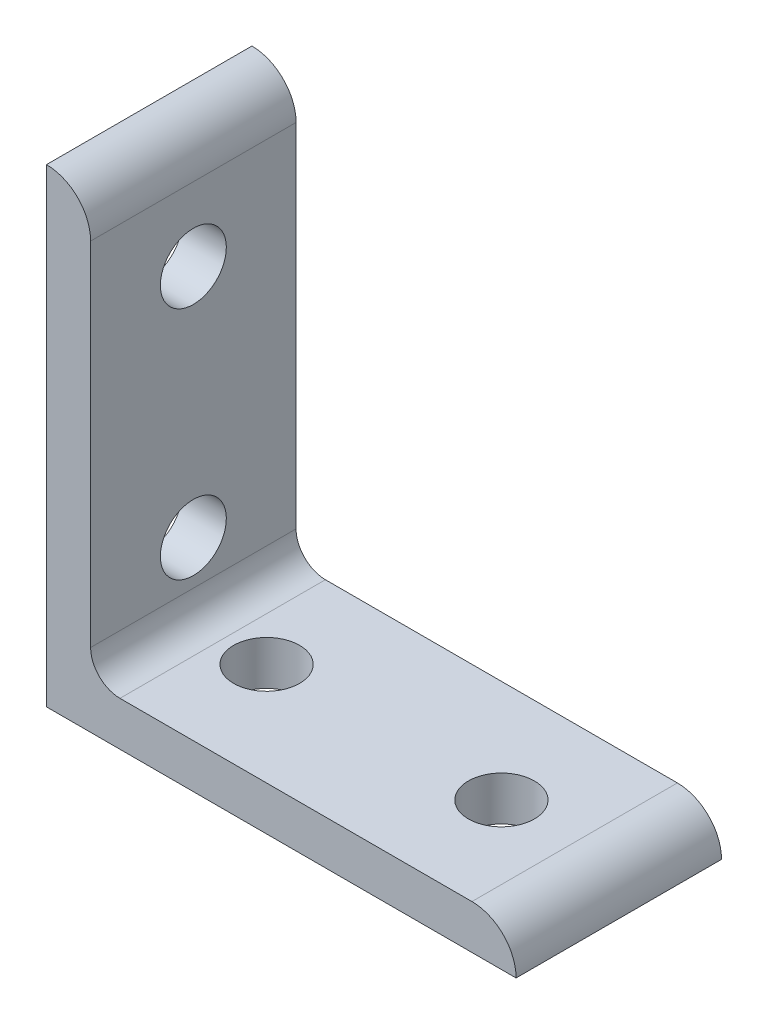
ISO-10303-21;
HEADER;
FILE_DESCRIPTION(('STEP AP214'),'2;1');
FILE_NAME('part.step','',(''),(''),'','','');
FILE_SCHEMA(('AUTOMOTIVE_DESIGN { 1 0 10303 214 1 1 1 1 }'));
ENDSEC;
DATA;
#1=APPLICATION_CONTEXT('core data for automotive mechanical design processes');
#2=APPLICATION_PROTOCOL_DEFINITION('international standard','automotive_design',2000,#1);
#3=PRODUCT_CONTEXT('',#1,'mechanical');
#4=PRODUCT('Part','Part','',(#3));
#5=PRODUCT_RELATED_PRODUCT_CATEGORY('part','',(#4));
#6=PRODUCT_DEFINITION_FORMATION('','',#4);
#7=PRODUCT_DEFINITION_CONTEXT('part definition',#1,'design');
#8=PRODUCT_DEFINITION('design','',#6,#7);
#9=PRODUCT_DEFINITION_SHAPE('','',#8);
#10=(LENGTH_UNIT() NAMED_UNIT(*) SI_UNIT(.MILLI.,.METRE.));
#11=(NAMED_UNIT(*) PLANE_ANGLE_UNIT() SI_UNIT($,.RADIAN.));
#12=(NAMED_UNIT(*) SI_UNIT($,.STERADIAN.) SOLID_ANGLE_UNIT());
#13=UNCERTAINTY_MEASURE_WITH_UNIT(LENGTH_MEASURE(1.E-05),#10,'distance_accuracy_value','');
#14=(GEOMETRIC_REPRESENTATION_CONTEXT(3) GLOBAL_UNCERTAINTY_ASSIGNED_CONTEXT((#13)) GLOBAL_UNIT_ASSIGNED_CONTEXT((#10,
#11,#12)) REPRESENTATION_CONTEXT('',''));
#15=CARTESIAN_POINT('',(0.,0.,0.));
#16=DIRECTION('',(0.,0.,1.));
#17=DIRECTION('',(1.,0.,0.));
#18=AXIS2_PLACEMENT_3D('',#15,#16,#17);
#19=CARTESIAN_POINT('',(4.7752,46.0248,11.1125));
#20=DIRECTION('',(-1.,0.,0.));
#21=DIRECTION('',(0.,-1.,0.));
#22=AXIS2_PLACEMENT_3D('',#19,#20,#21);
#23=PLANE('',#22);
#24=CARTESIAN_POINT('',(4.7752,12.7,0.));
#25=DIRECTION('',(-1.,0.,0.));
#26=DIRECTION('',(0.,-1.,0.));
#27=AXIS2_PLACEMENT_3D('',#24,#25,#26);
#28=CIRCLE('',#27,3.5687);
#29=CARTESIAN_POINT('',(4.7752,9.1313,0.));
#30=VERTEX_POINT('',#29);
#31=EDGE_CURVE('E208',#30,#30,#28,.F.);
#32=ORIENTED_EDGE('',*,*,#31,.F.);
#33=EDGE_LOOP('',(#32));
#34=FACE_BOUND('',#33,.T.);
#35=DIRECTION('',(0.,1.,0.));
#36=VECTOR('',#35,1.);
#37=CARTESIAN_POINT('',(4.7752,46.0248,-11.1125));
#38=LINE('',#37,#36);
#39=CARTESIAN_POINT('',(4.7752,7.9502,-11.1125));
#40=VERTEX_POINT('',#39);
#41=CARTESIAN_POINT('',(4.77519999999999,46.0248,-11.1125));
#42=VERTEX_POINT('',#41);
#43=EDGE_CURVE('E137',#40,#42,#38,.T.);
#44=ORIENTED_EDGE('',*,*,#43,.T.);
#45=DIRECTION('',(0.,0.,-1.));
#46=VECTOR('',#45,1.);
#47=CARTESIAN_POINT('',(4.77519999999999,46.0248,11.1125));
#48=LINE('',#47,#46);
#49=CARTESIAN_POINT('',(4.77519999999999,46.0248,11.1125));
#50=VERTEX_POINT('',#49);
#51=EDGE_CURVE('E134',#50,#42,#48,.T.);
#52=ORIENTED_EDGE('',*,*,#51,.F.);
#53=DIRECTION('',(0.,1.,0.));
#54=VECTOR('',#53,1.);
#55=CARTESIAN_POINT('',(4.7752,46.0248,11.1125));
#56=LINE('',#55,#54);
#57=CARTESIAN_POINT('',(4.7752,7.9502,11.1125));
#58=VERTEX_POINT('',#57);
#59=EDGE_CURVE('E122',#58,#50,#56,.T.);
#60=ORIENTED_EDGE('',*,*,#59,.F.);
#61=DIRECTION('',(0.,0.,-1.));
#62=VECTOR('',#61,1.);
#63=CARTESIAN_POINT('',(4.7752,7.9502,11.1125));
#64=LINE('',#63,#62);
#65=EDGE_CURVE('E139',#58,#40,#64,.T.);
#66=ORIENTED_EDGE('',*,*,#65,.T.);
#67=EDGE_LOOP('',(#44,#52,#60,#66));
#68=FACE_BOUND('',#67,.T.);
#69=CARTESIAN_POINT('',(4.77519999999999,38.1,0.));
#70=DIRECTION('',(-1.,0.,0.));
#71=DIRECTION('',(0.,-1.,0.));
#72=AXIS2_PLACEMENT_3D('',#69,#70,#71);
#73=CIRCLE('',#72,3.5687);
#74=CARTESIAN_POINT('',(4.77519999999999,34.5313,0.));
#75=VERTEX_POINT('',#74);
#76=EDGE_CURVE('E212',#75,#75,#73,.F.);
#77=ORIENTED_EDGE('',*,*,#76,.F.);
#78=EDGE_LOOP('',(#77));
#79=FACE_BOUND('',#78,.T.);
#80=ADVANCED_FACE('F38',(#34,#68,#79),#23,.F.);
#81=CARTESIAN_POINT('',(0.,0.,11.1125));
#82=DIRECTION('',(1.,0.,0.));
#83=DIRECTION('',(0.,0.,-1.));
#84=AXIS2_PLACEMENT_3D('',#81,#82,#83);
#85=PLANE('',#84);
#86=CARTESIAN_POINT('',(0.,12.7,0.));
#87=DIRECTION('',(1.,0.,0.));
#88=DIRECTION('',(0.,0.,-1.));
#89=AXIS2_PLACEMENT_3D('',#86,#87,#88);
#90=CIRCLE('',#89,3.5687);
#91=CARTESIAN_POINT('',(0.,12.7,-3.5687));
#92=VERTEX_POINT('',#91);
#93=EDGE_CURVE('E210',#92,#92,#90,.T.);
#94=ORIENTED_EDGE('',*,*,#93,.T.);
#95=EDGE_LOOP('',(#94));
#96=FACE_BOUND('',#95,.T.);
#97=DIRECTION('',(0.,-1.,0.));
#98=VECTOR('',#97,1.);
#99=CARTESIAN_POINT('',(0.,0.,-11.1125));
#100=LINE('',#99,#98);
#101=CARTESIAN_POINT('',(0.,50.8,-11.1125));
#102=VERTEX_POINT('',#101);
#103=CARTESIAN_POINT('',(0.,0.,-11.1125));
#104=VERTEX_POINT('',#103);
#105=EDGE_CURVE('E100',#102,#104,#100,.T.);
#106=ORIENTED_EDGE('',*,*,#105,.T.);
#107=DIRECTION('',(0.,0.,-1.));
#108=VECTOR('',#107,1.);
#109=CARTESIAN_POINT('',(0.,0.,11.1125));
#110=LINE('',#109,#108);
#111=CARTESIAN_POINT('',(0.,0.,11.1125));
#112=VERTEX_POINT('',#111);
#113=EDGE_CURVE('E146',#112,#104,#110,.T.);
#114=ORIENTED_EDGE('',*,*,#113,.F.);
#115=DIRECTION('',(0.,-1.,0.));
#116=VECTOR('',#115,1.);
#117=CARTESIAN_POINT('',(0.,0.,11.1125));
#118=LINE('',#117,#116);
#119=CARTESIAN_POINT('',(0.,50.8,11.1125));
#120=VERTEX_POINT('',#119);
#121=EDGE_CURVE('E60',#120,#112,#118,.T.);
#122=ORIENTED_EDGE('',*,*,#121,.F.);
#123=DIRECTION('',(0.,0.,-1.));
#124=VECTOR('',#123,1.);
#125=CARTESIAN_POINT('',(0.,50.8,11.1125));
#126=LINE('',#125,#124);
#127=EDGE_CURVE('E140',#120,#102,#126,.T.);
#128=ORIENTED_EDGE('',*,*,#127,.T.);
#129=EDGE_LOOP('',(#106,#114,#122,#128));
#130=FACE_BOUND('',#129,.T.);
#131=CARTESIAN_POINT('',(0.,38.1,0.));
#132=DIRECTION('',(1.,0.,0.));
#133=DIRECTION('',(0.,0.,-1.));
#134=AXIS2_PLACEMENT_3D('',#131,#132,#133);
#135=CIRCLE('',#134,3.5687);
#136=CARTESIAN_POINT('',(0.,38.1,-3.5687));
#137=VERTEX_POINT('',#136);
#138=EDGE_CURVE('E218',#137,#137,#135,.T.);
#139=ORIENTED_EDGE('',*,*,#138,.T.);
#140=EDGE_LOOP('',(#139));
#141=FACE_BOUND('',#140,.T.);
#142=ADVANCED_FACE('F225',(#96,#130,#141),#85,.F.);
#143=CARTESIAN_POINT('',(50.8,0.,11.1125));
#144=DIRECTION('',(0.,1.,0.));
#145=DIRECTION('',(-1.,0.,0.));
#146=AXIS2_PLACEMENT_3D('',#143,#144,#145);
#147=PLANE('',#146);
#148=CARTESIAN_POINT('',(12.7,0.,0.));
#149=DIRECTION('',(0.,1.,0.));
#150=DIRECTION('',(0.,0.,1.));
#151=AXIS2_PLACEMENT_3D('',#148,#149,#150);
#152=CIRCLE('',#151,3.5687);
#153=CARTESIAN_POINT('',(12.7,0.,3.5687));
#154=VERTEX_POINT('',#153);
#155=EDGE_CURVE('E185',#154,#154,#152,.T.);
#156=ORIENTED_EDGE('',*,*,#155,.T.);
#157=EDGE_LOOP('',(#156));
#158=FACE_BOUND('',#157,.T.);
#159=DIRECTION('',(1.,0.,0.));
#160=VECTOR('',#159,1.);
#161=CARTESIAN_POINT('',(50.8,0.,-11.1125));
#162=LINE('',#161,#160);
#163=CARTESIAN_POINT('',(50.8,0.,-11.1125));
#164=VERTEX_POINT('',#163);
#165=EDGE_CURVE('E150',#104,#164,#162,.T.);
#166=ORIENTED_EDGE('',*,*,#165,.T.);
#167=DIRECTION('',(0.,0.,-1.));
#168=VECTOR('',#167,1.);
#169=CARTESIAN_POINT('',(50.8,0.,11.1125));
#170=LINE('',#169,#168);
#171=CARTESIAN_POINT('',(50.8,0.,11.1125));
#172=VERTEX_POINT('',#171);
#173=EDGE_CURVE('E11',#172,#164,#170,.T.);
#174=ORIENTED_EDGE('',*,*,#173,.F.);
#175=DIRECTION('',(1.,0.,0.));
#176=VECTOR('',#175,1.);
#177=CARTESIAN_POINT('',(50.8,0.,11.1125));
#178=LINE('',#177,#176);
#179=EDGE_CURVE('E170',#112,#172,#178,.T.);
#180=ORIENTED_EDGE('',*,*,#179,.F.);
#181=ORIENTED_EDGE('',*,*,#113,.T.);
#182=EDGE_LOOP('',(#166,#174,#180,#181));
#183=FACE_BOUND('',#182,.T.);
#184=CARTESIAN_POINT('',(38.1,0.,0.));
#185=DIRECTION('',(0.,1.,0.));
#186=DIRECTION('',(0.,0.,1.));
#187=AXIS2_PLACEMENT_3D('',#184,#185,#186);
#188=CIRCLE('',#187,3.56869999999999);
#189=CARTESIAN_POINT('',(38.1,0.,3.56869999999999));
#190=VERTEX_POINT('',#189);
#191=EDGE_CURVE('E196',#190,#190,#188,.T.);
#192=ORIENTED_EDGE('',*,*,#191,.T.);
#193=EDGE_LOOP('',(#192));
#194=FACE_BOUND('',#193,.T.);
#195=ADVANCED_FACE('F40',(#158,#183,#194),#147,.F.);
#196=CARTESIAN_POINT('',(7.9502,4.7752,11.1125));
#197=DIRECTION('',(0.,-1.,0.));
#198=DIRECTION('',(1.,0.,0.));
#199=AXIS2_PLACEMENT_3D('',#196,#197,#198);
#200=PLANE('',#199);
#201=CARTESIAN_POINT('',(12.7,4.7752,0.));
#202=DIRECTION('',(0.,-1.,0.));
#203=DIRECTION('',(1.,0.,0.));
#204=AXIS2_PLACEMENT_3D('',#201,#202,#203);
#205=CIRCLE('',#204,3.5687);
#206=CARTESIAN_POINT('',(16.2687,4.7752,0.));
#207=VERTEX_POINT('',#206);
#208=EDGE_CURVE('E155',#207,#207,#205,.F.);
#209=ORIENTED_EDGE('',*,*,#208,.F.);
#210=EDGE_LOOP('',(#209));
#211=FACE_BOUND('',#210,.T.);
#212=DIRECTION('',(-1.,0.,0.));
#213=VECTOR('',#212,1.);
#214=CARTESIAN_POINT('',(7.9502,4.7752,-11.1125));
#215=LINE('',#214,#213);
#216=CARTESIAN_POINT('',(46.0248,4.7752,-11.1125));
#217=VERTEX_POINT('',#216);
#218=CARTESIAN_POINT('',(7.9502,4.7752,-11.1125));
#219=VERTEX_POINT('',#218);
#220=EDGE_CURVE('E158',#217,#219,#215,.T.);
#221=ORIENTED_EDGE('',*,*,#220,.T.);
#222=DIRECTION('',(0.,0.,-1.));
#223=VECTOR('',#222,1.);
#224=CARTESIAN_POINT('',(7.9502,4.7752,11.1125));
#225=LINE('',#224,#223);
#226=CARTESIAN_POINT('',(7.9502,4.7752,11.1125));
#227=VERTEX_POINT('',#226);
#228=EDGE_CURVE('E177',#227,#219,#225,.T.);
#229=ORIENTED_EDGE('',*,*,#228,.F.);
#230=DIRECTION('',(-1.,0.,0.));
#231=VECTOR('',#230,1.);
#232=CARTESIAN_POINT('',(7.9502,4.7752,11.1125));
#233=LINE('',#232,#231);
#234=CARTESIAN_POINT('',(46.0248,4.7752,11.1125));
#235=VERTEX_POINT('',#234);
#236=EDGE_CURVE('E204',#235,#227,#233,.T.);
#237=ORIENTED_EDGE('',*,*,#236,.F.);
#238=DIRECTION('',(0.,0.,-1.));
#239=VECTOR('',#238,1.);
#240=CARTESIAN_POINT('',(46.0248,4.7752,11.1125));
#241=LINE('',#240,#239);
#242=EDGE_CURVE('E49',#235,#217,#241,.T.);
#243=ORIENTED_EDGE('',*,*,#242,.T.);
#244=EDGE_LOOP('',(#221,#229,#237,#243));
#245=FACE_BOUND('',#244,.T.);
#246=CARTESIAN_POINT('',(38.1,4.7752,0.));
#247=DIRECTION('',(0.,-1.,0.));
#248=DIRECTION('',(1.,0.,0.));
#249=AXIS2_PLACEMENT_3D('',#246,#247,#248);
#250=CIRCLE('',#249,3.56869999999999);
#251=CARTESIAN_POINT('',(41.6687,4.7752,0.));
#252=VERTEX_POINT('',#251);
#253=EDGE_CURVE('E42',#252,#252,#250,.F.);
#254=ORIENTED_EDGE('',*,*,#253,.F.);
#255=EDGE_LOOP('',(#254));
#256=FACE_BOUND('',#255,.T.);
#257=ADVANCED_FACE('F248',(#211,#245,#256),#200,.F.);
#258=CARTESIAN_POINT('',(46.0248,0.,11.1125));
#259=DIRECTION('',(0.,0.,-1.));
#260=DIRECTION('',(-1.,0.,0.));
#261=AXIS2_PLACEMENT_3D('',#258,#259,#260);
#262=CYLINDRICAL_SURFACE('',#261,4.7752);
#263=CARTESIAN_POINT('',(46.0248,0.,-11.1125));
#264=DIRECTION('',(0.,0.,1.));
#265=DIRECTION('',(1.,0.,0.));
#266=AXIS2_PLACEMENT_3D('',#263,#264,#265);
#267=CIRCLE('',#266,4.7752);
#268=EDGE_CURVE('E154',#164,#217,#267,.T.);
#269=ORIENTED_EDGE('',*,*,#268,.T.);
#270=ORIENTED_EDGE('',*,*,#242,.F.);
#271=CARTESIAN_POINT('',(46.0248,0.,11.1125));
#272=DIRECTION('',(0.,0.,1.));
#273=DIRECTION('',(1.,0.,0.));
#274=AXIS2_PLACEMENT_3D('',#271,#272,#273);
#275=CIRCLE('',#274,4.7752);
#276=EDGE_CURVE('E109',#172,#235,#275,.T.);
#277=ORIENTED_EDGE('',*,*,#276,.F.);
#278=ORIENTED_EDGE('',*,*,#173,.T.);
#279=EDGE_LOOP('',(#269,#270,#277,#278));
#280=FACE_BOUND('',#279,.T.);
#281=ADVANCED_FACE('F246',(#280),#262,.T.);
#282=CARTESIAN_POINT('',(7.9502,7.9502,11.1125));
#283=DIRECTION('',(0.,0.,-1.));
#284=DIRECTION('',(-1.,0.,0.));
#285=AXIS2_PLACEMENT_3D('',#282,#283,#284);
#286=CYLINDRICAL_SURFACE('',#285,3.175);
#287=CARTESIAN_POINT('',(7.9502,7.9502,-11.1125));
#288=DIRECTION('',(0.,0.,-1.));
#289=DIRECTION('',(1.,0.,0.));
#290=AXIS2_PLACEMENT_3D('',#287,#288,#289);
#291=CIRCLE('',#290,3.175);
#292=EDGE_CURVE('E161',#219,#40,#291,.T.);
#293=ORIENTED_EDGE('',*,*,#292,.T.);
#294=ORIENTED_EDGE('',*,*,#65,.F.);
#295=CARTESIAN_POINT('',(7.9502,7.9502,11.1125));
#296=DIRECTION('',(0.,0.,-1.));
#297=DIRECTION('',(1.,0.,0.));
#298=AXIS2_PLACEMENT_3D('',#295,#296,#297);
#299=CIRCLE('',#298,3.175);
#300=EDGE_CURVE('E128',#227,#58,#299,.T.);
#301=ORIENTED_EDGE('',*,*,#300,.F.);
#302=ORIENTED_EDGE('',*,*,#228,.T.);
#303=EDGE_LOOP('',(#293,#294,#301,#302));
#304=FACE_BOUND('',#303,.T.);
#305=ADVANCED_FACE('F243',(#304),#286,.F.);
#306=CARTESIAN_POINT('',(0.,46.0248,11.1125));
#307=DIRECTION('',(0.,0.,-1.));
#308=DIRECTION('',(-1.,0.,0.));
#309=AXIS2_PLACEMENT_3D('',#306,#307,#308);
#310=CYLINDRICAL_SURFACE('',#309,4.77519999999999);
#311=CARTESIAN_POINT('',(0.,46.0248,-11.1125));
#312=DIRECTION('',(0.,0.,1.));
#313=DIRECTION('',(1.,0.,0.));
#314=AXIS2_PLACEMENT_3D('',#311,#312,#313);
#315=CIRCLE('',#314,4.77519999999999);
#316=EDGE_CURVE('E93',#42,#102,#315,.T.);
#317=ORIENTED_EDGE('',*,*,#316,.T.);
#318=ORIENTED_EDGE('',*,*,#127,.F.);
#319=CARTESIAN_POINT('',(0.,46.0248,11.1125));
#320=DIRECTION('',(0.,0.,1.));
#321=DIRECTION('',(1.,0.,0.));
#322=AXIS2_PLACEMENT_3D('',#319,#320,#321);
#323=CIRCLE('',#322,4.77519999999999);
#324=EDGE_CURVE('E126',#50,#120,#323,.T.);
#325=ORIENTED_EDGE('',*,*,#324,.F.);
#326=ORIENTED_EDGE('',*,*,#51,.T.);
#327=EDGE_LOOP('',(#317,#318,#325,#326));
#328=FACE_BOUND('',#327,.T.);
#329=ADVANCED_FACE('F142',(#328),#310,.T.);
#330=CARTESIAN_POINT('',(0.,46.0248,11.1125));
#331=DIRECTION('',(0.,0.,1.));
#332=DIRECTION('',(1.,0.,0.));
#333=AXIS2_PLACEMENT_3D('',#330,#331,#332);
#334=PLANE('',#333);
#335=ORIENTED_EDGE('',*,*,#179,.T.);
#336=ORIENTED_EDGE('',*,*,#276,.T.);
#337=ORIENTED_EDGE('',*,*,#236,.T.);
#338=ORIENTED_EDGE('',*,*,#300,.T.);
#339=ORIENTED_EDGE('',*,*,#59,.T.);
#340=ORIENTED_EDGE('',*,*,#324,.T.);
#341=ORIENTED_EDGE('',*,*,#121,.T.);
#342=EDGE_LOOP('',(#335,#336,#337,#338,#339,#340,#341));
#343=FACE_BOUND('',#342,.T.);
#344=ADVANCED_FACE('F124',(#343),#334,.T.);
#345=CARTESIAN_POINT('',(0.,46.0248,-11.1125));
#346=DIRECTION('',(0.,0.,1.));
#347=DIRECTION('',(1.,0.,0.));
#348=AXIS2_PLACEMENT_3D('',#345,#346,#347);
#349=PLANE('',#348);
#350=ORIENTED_EDGE('',*,*,#165,.F.);
#351=ORIENTED_EDGE('',*,*,#105,.F.);
#352=ORIENTED_EDGE('',*,*,#316,.F.);
#353=ORIENTED_EDGE('',*,*,#43,.F.);
#354=ORIENTED_EDGE('',*,*,#292,.F.);
#355=ORIENTED_EDGE('',*,*,#220,.F.);
#356=ORIENTED_EDGE('',*,*,#268,.F.);
#357=EDGE_LOOP('',(#350,#351,#352,#353,#354,#355,#356));
#358=FACE_BOUND('',#357,.T.);
#359=ADVANCED_FACE('F263',(#358),#349,.F.);
#360=CARTESIAN_POINT('',(12.7,50.8,0.));
#361=DIRECTION('',(0.,-1.,0.));
#362=DIRECTION('',(0.,0.,-1.));
#363=AXIS2_PLACEMENT_3D('',#360,#361,#362);
#364=CYLINDRICAL_SURFACE('',#363,3.5687);
#365=ORIENTED_EDGE('',*,*,#155,.F.);
#366=EDGE_LOOP('',(#365));
#367=FACE_BOUND('',#366,.T.);
#368=ORIENTED_EDGE('',*,*,#208,.T.);
#369=EDGE_LOOP('',(#368));
#370=FACE_BOUND('',#369,.T.);
#371=ADVANCED_FACE('F275',(#367,#370),#364,.F.);
#372=CARTESIAN_POINT('',(38.1,50.8,0.));
#373=DIRECTION('',(0.,-1.,0.));
#374=DIRECTION('',(0.,0.,-1.));
#375=AXIS2_PLACEMENT_3D('',#372,#373,#374);
#376=CYLINDRICAL_SURFACE('',#375,3.56869999999999);
#377=ORIENTED_EDGE('',*,*,#191,.F.);
#378=EDGE_LOOP('',(#377));
#379=FACE_BOUND('',#378,.T.);
#380=ORIENTED_EDGE('',*,*,#253,.T.);
#381=EDGE_LOOP('',(#380));
#382=FACE_BOUND('',#381,.T.);
#383=ADVANCED_FACE('F272',(#379,#382),#376,.F.);
#384=CARTESIAN_POINT('',(50.8,12.7,0.));
#385=DIRECTION('',(-1.,0.,0.));
#386=DIRECTION('',(0.,0.,1.));
#387=AXIS2_PLACEMENT_3D('',#384,#385,#386);
#388=CYLINDRICAL_SURFACE('',#387,3.5687);
#389=ORIENTED_EDGE('',*,*,#93,.F.);
#390=EDGE_LOOP('',(#389));
#391=FACE_BOUND('',#390,.T.);
#392=ORIENTED_EDGE('',*,*,#31,.T.);
#393=EDGE_LOOP('',(#392));
#394=FACE_BOUND('',#393,.T.);
#395=ADVANCED_FACE('F230',(#391,#394),#388,.F.);
#396=CARTESIAN_POINT('',(50.8,38.1,0.));
#397=DIRECTION('',(-1.,0.,0.));
#398=DIRECTION('',(0.,0.,1.));
#399=AXIS2_PLACEMENT_3D('',#396,#397,#398);
#400=CYLINDRICAL_SURFACE('',#399,3.5687);
#401=ORIENTED_EDGE('',*,*,#138,.F.);
#402=EDGE_LOOP('',(#401));
#403=FACE_BOUND('',#402,.T.);
#404=ORIENTED_EDGE('',*,*,#76,.T.);
#405=EDGE_LOOP('',(#404));
#406=FACE_BOUND('',#405,.T.);
#407=ADVANCED_FACE('F227',(#403,#406),#400,.F.);
#408=CLOSED_SHELL('',(#80,#142,#195,#257,#281,#305,#329,#344,#359,#371,#383,#395,#407));
#409=MANIFOLD_SOLID_BREP('B2',#408);
#410=ADVANCED_BREP_SHAPE_REPRESENTATION('',(#18,#409),#14);
#411=SHAPE_DEFINITION_REPRESENTATION(#9,#410);
ENDSEC;
END-ISO-10303-21;
